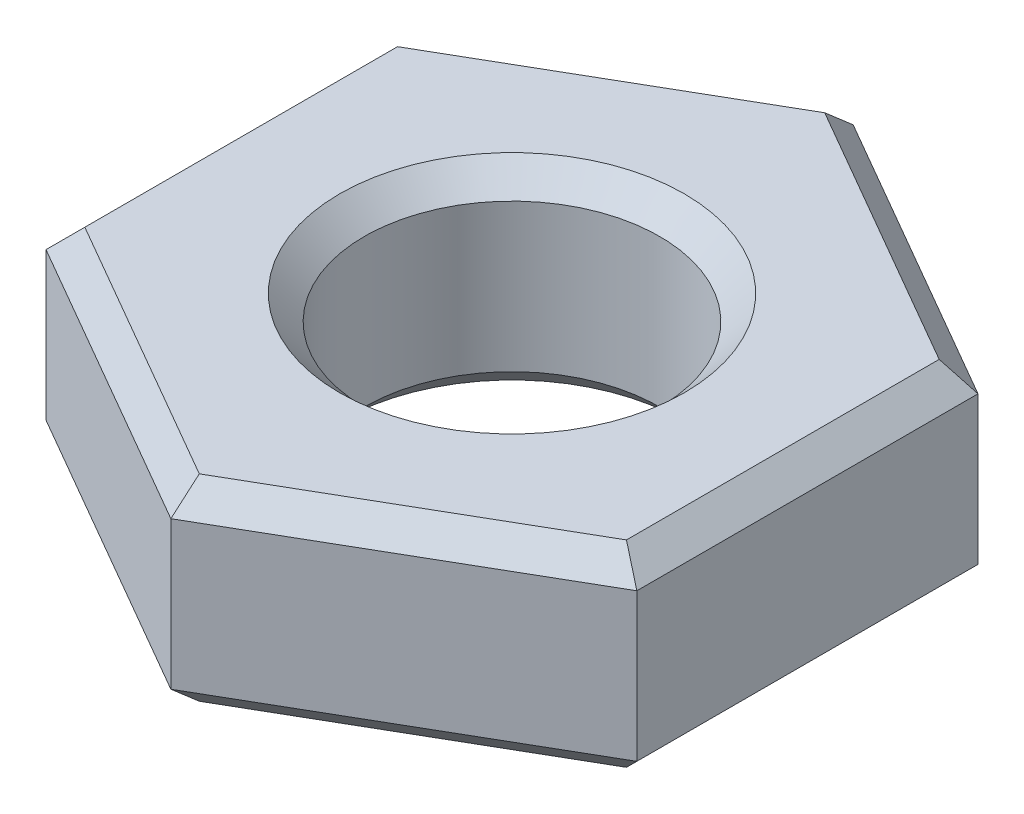
ISO-10303-21;
HEADER;
FILE_DESCRIPTION(('STEP AP214'),'2;1');
FILE_NAME('part.step','',(''),(''),'','','');
FILE_SCHEMA(('AUTOMOTIVE_DESIGN { 1 0 10303 214 1 1 1 1 }'));
ENDSEC;
DATA;
#1=APPLICATION_CONTEXT('core data for automotive mechanical design processes');
#2=APPLICATION_PROTOCOL_DEFINITION('international standard','automotive_design',2000,#1);
#3=PRODUCT_CONTEXT('',#1,'mechanical');
#4=PRODUCT('Part','Part','',(#3));
#5=PRODUCT_RELATED_PRODUCT_CATEGORY('part','',(#4));
#6=PRODUCT_DEFINITION_FORMATION('','',#4);
#7=PRODUCT_DEFINITION_CONTEXT('part definition',#1,'design');
#8=PRODUCT_DEFINITION('design','',#6,#7);
#9=PRODUCT_DEFINITION_SHAPE('','',#8);
#10=(LENGTH_UNIT() NAMED_UNIT(*) SI_UNIT(.MILLI.,.METRE.));
#11=(NAMED_UNIT(*) PLANE_ANGLE_UNIT() SI_UNIT($,.RADIAN.));
#12=(NAMED_UNIT(*) SI_UNIT($,.STERADIAN.) SOLID_ANGLE_UNIT());
#13=UNCERTAINTY_MEASURE_WITH_UNIT(LENGTH_MEASURE(1.E-05),#10,'distance_accuracy_value','');
#14=(GEOMETRIC_REPRESENTATION_CONTEXT(3) GLOBAL_UNCERTAINTY_ASSIGNED_CONTEXT((#13)) GLOBAL_UNIT_ASSIGNED_CONTEXT((#10,
#11,#12)) REPRESENTATION_CONTEXT('',''));
#15=CARTESIAN_POINT('',(0.,0.,0.));
#16=DIRECTION('',(0.,0.,1.));
#17=DIRECTION('',(1.,0.,0.));
#18=AXIS2_PLACEMENT_3D('',#15,#16,#17);
#19=CARTESIAN_POINT('',(0.,2.,0.));
#20=DIRECTION('',(0.,1.,0.));
#21=DIRECTION('',(0.,0.,1.));
#22=AXIS2_PLACEMENT_3D('',#19,#20,#21);
#23=PLANE('',#22);
#24=CARTESIAN_POINT('',(0.,2.,0.));
#25=DIRECTION('',(0.,1.,0.));
#26=DIRECTION('',(0.,0.,1.));
#27=AXIS2_PLACEMENT_3D('',#24,#25,#26);
#28=CIRCLE('',#27,1.75);
#29=CARTESIAN_POINT('',(0.,2.,1.75));
#30=VERTEX_POINT('',#29);
#31=EDGE_CURVE('E11',#30,#30,#28,.F.);
#32=ORIENTED_EDGE('',*,*,#31,.T.);
#33=EDGE_LOOP('',(#32));
#34=FACE_BOUND('',#33,.T.);
#35=DIRECTION('',(-0.866025403784439,0.,0.5));
#36=VECTOR('',#35,1.);
#37=CARTESIAN_POINT('',(-2.875,2.,-1.51554445662277));
#38=LINE('',#37,#36);
#39=CARTESIAN_POINT('',(0.,2.,-3.17542648054294));
#40=VERTEX_POINT('',#39);
#41=CARTESIAN_POINT('',(-2.75,2.,-1.58771324027147));
#42=VERTEX_POINT('',#41);
#43=EDGE_CURVE('E60',#40,#42,#38,.T.);
#44=ORIENTED_EDGE('',*,*,#43,.T.);
#45=DIRECTION('',(0.,0.,1.));
#46=VECTOR('',#45,1.);
#47=CARTESIAN_POINT('',(-2.75,2.,1.73205080756888));
#48=LINE('',#47,#46);
#49=CARTESIAN_POINT('',(-2.75,2.,1.58771324027147));
#50=VERTEX_POINT('',#49);
#51=EDGE_CURVE('E52',#42,#50,#48,.T.);
#52=ORIENTED_EDGE('',*,*,#51,.T.);
#53=DIRECTION('',(0.866025403784439,0.,0.5));
#54=VECTOR('',#53,1.);
#55=CARTESIAN_POINT('',(0.125,2.,3.24759526419165));
#56=LINE('',#55,#54);
#57=CARTESIAN_POINT('',(0.,2.,3.17542648054294));
#58=VERTEX_POINT('',#57);
#59=EDGE_CURVE('E218',#50,#58,#56,.T.);
#60=ORIENTED_EDGE('',*,*,#59,.T.);
#61=DIRECTION('',(0.866025403784439,0.,-0.5));
#62=VECTOR('',#61,1.);
#63=CARTESIAN_POINT('',(2.875,2.,1.51554445662277));
#64=LINE('',#63,#62);
#65=CARTESIAN_POINT('',(2.75,2.,1.58771324027147));
#66=VERTEX_POINT('',#65);
#67=EDGE_CURVE('E221',#58,#66,#64,.T.);
#68=ORIENTED_EDGE('',*,*,#67,.T.);
#69=DIRECTION('',(0.,0.,-1.));
#70=VECTOR('',#69,1.);
#71=CARTESIAN_POINT('',(2.75,2.,-1.73205080756888));
#72=LINE('',#71,#70);
#73=CARTESIAN_POINT('',(2.75,2.,-1.58771324027147));
#74=VERTEX_POINT('',#73);
#75=EDGE_CURVE('E224',#66,#74,#72,.T.);
#76=ORIENTED_EDGE('',*,*,#75,.T.);
#77=DIRECTION('',(-0.866025403784439,0.,-0.5));
#78=VECTOR('',#77,1.);
#79=CARTESIAN_POINT('',(-0.125,2.,-3.24759526419165));
#80=LINE('',#79,#78);
#81=EDGE_CURVE('E65',#74,#40,#80,.T.);
#82=ORIENTED_EDGE('',*,*,#81,.T.);
#83=EDGE_LOOP('',(#44,#52,#60,#68,#76,#82));
#84=FACE_BOUND('',#83,.T.);
#85=ADVANCED_FACE('F41',(#34,#84),#23,.T.);
#86=CARTESIAN_POINT('',(0.,0.,0.));
#87=DIRECTION('',(0.,1.,0.));
#88=DIRECTION('',(0.,0.,1.));
#89=AXIS2_PLACEMENT_3D('',#86,#87,#88);
#90=PLANE('',#89);
#91=CARTESIAN_POINT('',(0.,0.,0.));
#92=DIRECTION('',(0.,1.,0.));
#93=DIRECTION('',(0.,0.,1.));
#94=AXIS2_PLACEMENT_3D('',#91,#92,#93);
#95=CIRCLE('',#94,1.75);
#96=CARTESIAN_POINT('',(0.,0.,1.75));
#97=VERTEX_POINT('',#96);
#98=EDGE_CURVE('E164',#97,#97,#95,.T.);
#99=ORIENTED_EDGE('',*,*,#98,.T.);
#100=EDGE_LOOP('',(#99));
#101=FACE_BOUND('',#100,.T.);
#102=DIRECTION('',(0.,0.,1.));
#103=VECTOR('',#102,1.);
#104=CARTESIAN_POINT('',(2.75,0.,0.));
#105=LINE('',#104,#103);
#106=CARTESIAN_POINT('',(2.75,0.,-1.58771324027147));
#107=VERTEX_POINT('',#106);
#108=CARTESIAN_POINT('',(2.75,0.,1.58771324027147));
#109=VERTEX_POINT('',#108);
#110=EDGE_CURVE('E162',#107,#109,#105,.T.);
#111=ORIENTED_EDGE('',*,*,#110,.T.);
#112=DIRECTION('',(-0.866025403784439,0.,0.5));
#113=VECTOR('',#112,1.);
#114=CARTESIAN_POINT('',(1.375,0.,2.38156986040721));
#115=LINE('',#114,#113);
#116=CARTESIAN_POINT('',(0.,0.,3.17542648054294));
#117=VERTEX_POINT('',#116);
#118=EDGE_CURVE('E139',#109,#117,#115,.T.);
#119=ORIENTED_EDGE('',*,*,#118,.T.);
#120=DIRECTION('',(-0.866025403784439,0.,-0.5));
#121=VECTOR('',#120,1.);
#122=CARTESIAN_POINT('',(-1.375,0.,2.38156986040721));
#123=LINE('',#122,#121);
#124=CARTESIAN_POINT('',(-2.75,0.,1.58771324027147));
#125=VERTEX_POINT('',#124);
#126=EDGE_CURVE('E150',#117,#125,#123,.T.);
#127=ORIENTED_EDGE('',*,*,#126,.T.);
#128=DIRECTION('',(0.,0.,-1.));
#129=VECTOR('',#128,1.);
#130=CARTESIAN_POINT('',(-2.75,0.,0.));
#131=LINE('',#130,#129);
#132=CARTESIAN_POINT('',(-2.75,0.,-1.58771324027147));
#133=VERTEX_POINT('',#132);
#134=EDGE_CURVE('E157',#125,#133,#131,.T.);
#135=ORIENTED_EDGE('',*,*,#134,.T.);
#136=DIRECTION('',(0.866025403784439,0.,-0.5));
#137=VECTOR('',#136,1.);
#138=CARTESIAN_POINT('',(-1.375,0.,-2.38156986040721));
#139=LINE('',#138,#137);
#140=CARTESIAN_POINT('',(0.,0.,-3.17542648054294));
#141=VERTEX_POINT('',#140);
#142=EDGE_CURVE('E301',#133,#141,#139,.T.);
#143=ORIENTED_EDGE('',*,*,#142,.T.);
#144=DIRECTION('',(0.866025403784439,0.,0.5));
#145=VECTOR('',#144,1.);
#146=CARTESIAN_POINT('',(1.375,0.,-2.38156986040721));
#147=LINE('',#146,#145);
#148=EDGE_CURVE('E171',#141,#107,#147,.T.);
#149=ORIENTED_EDGE('',*,*,#148,.T.);
#150=EDGE_LOOP('',(#111,#119,#127,#135,#143,#149));
#151=FACE_BOUND('',#150,.T.);
#152=ADVANCED_FACE('F160',(#101,#151),#90,.F.);
#153=CARTESIAN_POINT('',(-3.,2.,1.73205080756888));
#154=DIRECTION('',(0.5,0.,-0.866025403784439));
#155=DIRECTION('',(-0.866025403784439,0.,-0.5));
#156=AXIS2_PLACEMENT_3D('',#153,#154,#155);
#157=PLANE('',#156);
#158=DIRECTION('',(0.,-1.,0.));
#159=VECTOR('',#158,1.);
#160=CARTESIAN_POINT('',(-3.,2.,1.73205080756888));
#161=LINE('',#160,#159);
#162=CARTESIAN_POINT('',(-3.,1.75,1.73205080756888));
#163=VERTEX_POINT('',#162);
#164=CARTESIAN_POINT('',(-3.,0.25,1.73205080756888));
#165=VERTEX_POINT('',#164);
#166=EDGE_CURVE('E248',#163,#165,#161,.T.);
#167=ORIENTED_EDGE('',*,*,#166,.T.);
#168=DIRECTION('',(0.866025403784439,0.,0.5));
#169=VECTOR('',#168,1.);
#170=CARTESIAN_POINT('',(-3.,0.25,1.73205080756888));
#171=LINE('',#170,#169);
#172=CARTESIAN_POINT('',(0.,0.25,3.46410161513775));
#173=VERTEX_POINT('',#172);
#174=EDGE_CURVE('E215',#165,#173,#171,.T.);
#175=ORIENTED_EDGE('',*,*,#174,.T.);
#176=DIRECTION('',(0.,-1.,0.));
#177=VECTOR('',#176,1.);
#178=CARTESIAN_POINT('',(0.,2.,3.46410161513775));
#179=LINE('',#178,#177);
#180=CARTESIAN_POINT('',(0.,1.75,3.46410161513775));
#181=VERTEX_POINT('',#180);
#182=EDGE_CURVE('E158',#181,#173,#179,.T.);
#183=ORIENTED_EDGE('',*,*,#182,.F.);
#184=DIRECTION('',(-0.866025403784439,0.,-0.5));
#185=VECTOR('',#184,1.);
#186=CARTESIAN_POINT('',(-3.,1.75,1.73205080756888));
#187=LINE('',#186,#185);
#188=EDGE_CURVE('E212',#181,#163,#187,.T.);
#189=ORIENTED_EDGE('',*,*,#188,.T.);
#190=EDGE_LOOP('',(#167,#175,#183,#189));
#191=FACE_BOUND('',#190,.T.);
#192=ADVANCED_FACE('F330',(#191),#157,.F.);
#193=CARTESIAN_POINT('',(0.,2.,3.46410161513775));
#194=DIRECTION('',(-0.5,0.,-0.866025403784439));
#195=DIRECTION('',(-0.866025403784439,0.,0.5));
#196=AXIS2_PLACEMENT_3D('',#193,#194,#195);
#197=PLANE('',#196);
#198=ORIENTED_EDGE('',*,*,#182,.T.);
#199=DIRECTION('',(0.866025403784439,0.,-0.5));
#200=VECTOR('',#199,1.);
#201=CARTESIAN_POINT('',(0.,0.249999999999999,3.46410161513775));
#202=LINE('',#201,#200);
#203=CARTESIAN_POINT('',(3.,0.249999999999999,1.73205080756888));
#204=VERTEX_POINT('',#203);
#205=EDGE_CURVE('E142',#173,#204,#202,.T.);
#206=ORIENTED_EDGE('',*,*,#205,.T.);
#207=DIRECTION('',(0.,-1.,0.));
#208=VECTOR('',#207,1.);
#209=CARTESIAN_POINT('',(3.,2.,1.73205080756888));
#210=LINE('',#209,#208);
#211=CARTESIAN_POINT('',(3.,1.75,1.73205080756888));
#212=VERTEX_POINT('',#211);
#213=EDGE_CURVE('E283',#212,#204,#210,.T.);
#214=ORIENTED_EDGE('',*,*,#213,.F.);
#215=DIRECTION('',(-0.866025403784439,0.,0.5));
#216=VECTOR('',#215,1.);
#217=CARTESIAN_POINT('',(0.,1.75,3.46410161513775));
#218=LINE('',#217,#216);
#219=EDGE_CURVE('E182',#212,#181,#218,.T.);
#220=ORIENTED_EDGE('',*,*,#219,.T.);
#221=EDGE_LOOP('',(#198,#206,#214,#220));
#222=FACE_BOUND('',#221,.T.);
#223=ADVANCED_FACE('F288',(#222),#197,.F.);
#224=CARTESIAN_POINT('',(3.,2.,1.73205080756888));
#225=DIRECTION('',(-1.,0.,0.));
#226=DIRECTION('',(0.,0.,1.));
#227=AXIS2_PLACEMENT_3D('',#224,#225,#226);
#228=PLANE('',#227);
#229=ORIENTED_EDGE('',*,*,#213,.T.);
#230=DIRECTION('',(0.,0.,-1.));
#231=VECTOR('',#230,1.);
#232=CARTESIAN_POINT('',(3.,0.249999999999999,1.73205080756888));
#233=LINE('',#232,#231);
#234=CARTESIAN_POINT('',(3.,0.25,-1.73205080756888));
#235=VERTEX_POINT('',#234);
#236=EDGE_CURVE('E190',#204,#235,#233,.T.);
#237=ORIENTED_EDGE('',*,*,#236,.T.);
#238=DIRECTION('',(0.,-1.,0.));
#239=VECTOR('',#238,1.);
#240=CARTESIAN_POINT('',(3.,2.,-1.73205080756888));
#241=LINE('',#240,#239);
#242=CARTESIAN_POINT('',(3.,1.75,-1.73205080756888));
#243=VERTEX_POINT('',#242);
#244=EDGE_CURVE('E285',#243,#235,#241,.T.);
#245=ORIENTED_EDGE('',*,*,#244,.F.);
#246=DIRECTION('',(0.,0.,1.));
#247=VECTOR('',#246,1.);
#248=CARTESIAN_POINT('',(3.,1.75,1.73205080756888));
#249=LINE('',#248,#247);
#250=EDGE_CURVE('E187',#243,#212,#249,.T.);
#251=ORIENTED_EDGE('',*,*,#250,.T.);
#252=EDGE_LOOP('',(#229,#237,#245,#251));
#253=FACE_BOUND('',#252,.T.);
#254=ADVANCED_FACE('F282',(#253),#228,.F.);
#255=CARTESIAN_POINT('',(3.,2.,-1.73205080756888));
#256=DIRECTION('',(-0.5,0.,0.866025403784439));
#257=DIRECTION('',(0.866025403784439,0.,0.5));
#258=AXIS2_PLACEMENT_3D('',#255,#256,#257);
#259=PLANE('',#258);
#260=ORIENTED_EDGE('',*,*,#244,.T.);
#261=DIRECTION('',(-0.866025403784439,0.,-0.5));
#262=VECTOR('',#261,1.);
#263=CARTESIAN_POINT('',(3.,0.25,-1.73205080756888));
#264=LINE('',#263,#262);
#265=CARTESIAN_POINT('',(0.,0.249999999999999,-3.46410161513776));
#266=VERTEX_POINT('',#265);
#267=EDGE_CURVE('E196',#235,#266,#264,.T.);
#268=ORIENTED_EDGE('',*,*,#267,.T.);
#269=DIRECTION('',(0.,-1.,0.));
#270=VECTOR('',#269,1.);
#271=CARTESIAN_POINT('',(0.,2.,-3.46410161513776));
#272=LINE('',#271,#270);
#273=CARTESIAN_POINT('',(0.,1.75,-3.46410161513776));
#274=VERTEX_POINT('',#273);
#275=EDGE_CURVE('E295',#274,#266,#272,.T.);
#276=ORIENTED_EDGE('',*,*,#275,.F.);
#277=DIRECTION('',(0.866025403784439,0.,0.5));
#278=VECTOR('',#277,1.);
#279=CARTESIAN_POINT('',(3.,1.75,-1.73205080756888));
#280=LINE('',#279,#278);
#281=EDGE_CURVE('E193',#274,#243,#280,.T.);
#282=ORIENTED_EDGE('',*,*,#281,.T.);
#283=EDGE_LOOP('',(#260,#268,#276,#282));
#284=FACE_BOUND('',#283,.T.);
#285=ADVANCED_FACE('F315',(#284),#259,.F.);
#286=CARTESIAN_POINT('',(0.,2.,-3.46410161513776));
#287=DIRECTION('',(0.5,0.,0.866025403784439));
#288=DIRECTION('',(0.866025403784439,0.,-0.5));
#289=AXIS2_PLACEMENT_3D('',#286,#287,#288);
#290=PLANE('',#289);
#291=ORIENTED_EDGE('',*,*,#275,.T.);
#292=DIRECTION('',(-0.866025403784439,0.,0.5));
#293=VECTOR('',#292,1.);
#294=CARTESIAN_POINT('',(0.,0.249999999999999,-3.46410161513776));
#295=LINE('',#294,#293);
#296=CARTESIAN_POINT('',(-3.,0.249999999999999,-1.73205080756888));
#297=VERTEX_POINT('',#296);
#298=EDGE_CURVE('E202',#266,#297,#295,.T.);
#299=ORIENTED_EDGE('',*,*,#298,.T.);
#300=DIRECTION('',(0.,-1.,0.));
#301=VECTOR('',#300,1.);
#302=CARTESIAN_POINT('',(-3.,2.,-1.73205080756888));
#303=LINE('',#302,#301);
#304=CARTESIAN_POINT('',(-3.,1.75,-1.73205080756888));
#305=VERTEX_POINT('',#304);
#306=EDGE_CURVE('E321',#305,#297,#303,.T.);
#307=ORIENTED_EDGE('',*,*,#306,.F.);
#308=DIRECTION('',(0.866025403784439,0.,-0.5));
#309=VECTOR('',#308,1.);
#310=CARTESIAN_POINT('',(0.,1.75,-3.46410161513776));
#311=LINE('',#310,#309);
#312=EDGE_CURVE('E199',#305,#274,#311,.T.);
#313=ORIENTED_EDGE('',*,*,#312,.T.);
#314=EDGE_LOOP('',(#291,#299,#307,#313));
#315=FACE_BOUND('',#314,.T.);
#316=ADVANCED_FACE('F341',(#315),#290,.F.);
#317=CARTESIAN_POINT('',(-3.,2.,-1.73205080756888));
#318=DIRECTION('',(1.,0.,0.));
#319=DIRECTION('',(0.,0.,-1.));
#320=AXIS2_PLACEMENT_3D('',#317,#318,#319);
#321=PLANE('',#320);
#322=ORIENTED_EDGE('',*,*,#306,.T.);
#323=DIRECTION('',(0.,0.,1.));
#324=VECTOR('',#323,1.);
#325=CARTESIAN_POINT('',(-3.,0.249999999999999,-1.73205080756888));
#326=LINE('',#325,#324);
#327=EDGE_CURVE('E209',#297,#165,#326,.T.);
#328=ORIENTED_EDGE('',*,*,#327,.T.);
#329=ORIENTED_EDGE('',*,*,#166,.F.);
#330=DIRECTION('',(0.,0.,-1.));
#331=VECTOR('',#330,1.);
#332=CARTESIAN_POINT('',(-3.,1.75,-1.73205080756888));
#333=LINE('',#332,#331);
#334=EDGE_CURVE('E205',#163,#305,#333,.T.);
#335=ORIENTED_EDGE('',*,*,#334,.T.);
#336=EDGE_LOOP('',(#322,#328,#329,#335));
#337=FACE_BOUND('',#336,.T.);
#338=ADVANCED_FACE('F342',(#337),#321,.F.);
#339=CARTESIAN_POINT('',(0.,2.,0.));
#340=DIRECTION('',(0.,-1.,0.));
#341=DIRECTION('',(0.,0.,-1.));
#342=AXIS2_PLACEMENT_3D('',#339,#340,#341);
#343=CYLINDRICAL_SURFACE('',#342,1.5);
#344=CARTESIAN_POINT('',(0.,0.25,0.));
#345=DIRECTION('',(0.,1.,0.));
#346=DIRECTION('',(0.,0.,1.));
#347=AXIS2_PLACEMENT_3D('',#344,#345,#346);
#348=CIRCLE('',#347,1.5);
#349=CARTESIAN_POINT('',(0.,0.25,1.5));
#350=VERTEX_POINT('',#349);
#351=EDGE_CURVE('E178',#350,#350,#348,.F.);
#352=ORIENTED_EDGE('',*,*,#351,.T.);
#353=EDGE_LOOP('',(#352));
#354=FACE_BOUND('',#353,.T.);
#355=CARTESIAN_POINT('',(0.,1.75,0.));
#356=DIRECTION('',(0.,1.,0.));
#357=DIRECTION('',(0.,0.,1.));
#358=AXIS2_PLACEMENT_3D('',#355,#356,#357);
#359=CIRCLE('',#358,1.5);
#360=CARTESIAN_POINT('',(0.,1.75,1.5));
#361=VERTEX_POINT('',#360);
#362=EDGE_CURVE('E169',#361,#361,#359,.T.);
#363=ORIENTED_EDGE('',*,*,#362,.T.);
#364=EDGE_LOOP('',(#363));
#365=FACE_BOUND('',#364,.T.);
#366=ADVANCED_FACE('F361',(#354,#365),#343,.F.);
#367=CARTESIAN_POINT('',(0.,0.,0.));
#368=DIRECTION('',(0.,-1.,0.));
#369=DIRECTION('',(0.,0.,-1.));
#370=AXIS2_PLACEMENT_3D('',#367,#368,#369);
#371=CONICAL_SURFACE('',#370,1.75,0.785398163397445);
#372=ORIENTED_EDGE('',*,*,#351,.F.);
#373=EDGE_LOOP('',(#372));
#374=FACE_BOUND('',#373,.T.);
#375=ORIENTED_EDGE('',*,*,#98,.F.);
#376=EDGE_LOOP('',(#375));
#377=FACE_BOUND('',#376,.T.);
#378=ADVANCED_FACE('F376',(#374,#377),#371,.F.);
#379=CARTESIAN_POINT('',(0.,0.249999999999999,-3.46410161513776));
#380=DIRECTION('',(0.353553390593273,0.707106781186549,0.612372435695793));
#381=DIRECTION('',(-0.866025403784439,0.,0.5));
#382=AXIS2_PLACEMENT_3D('',#379,#380,#381);
#383=PLANE('',#382);
#384=DIRECTION('',(0.,-0.654653670707976,0.755928946018456));
#385=VECTOR('',#384,1.);
#386=CARTESIAN_POINT('',(0.,0.249999999999999,-3.46410161513776));
#387=LINE('',#386,#385);
#388=EDGE_CURVE('E240',#141,#266,#387,.F.);
#389=ORIENTED_EDGE('',*,*,#388,.F.);
#390=ORIENTED_EDGE('',*,*,#142,.F.);
#391=DIRECTION('',(0.654653670707978,-0.654653670707976,0.377964473009228));
#392=VECTOR('',#391,1.);
#393=CARTESIAN_POINT('',(-3.,0.249999999999999,-1.73205080756888));
#394=LINE('',#393,#392);
#395=EDGE_CURVE('E244',#297,#133,#394,.T.);
#396=ORIENTED_EDGE('',*,*,#395,.F.);
#397=ORIENTED_EDGE('',*,*,#298,.F.);
#398=EDGE_LOOP('',(#389,#390,#396,#397));
#399=FACE_BOUND('',#398,.T.);
#400=ADVANCED_FACE('F339',(#399),#383,.F.);
#401=CARTESIAN_POINT('',(-3.,0.249999999999999,-1.73205080756888));
#402=DIRECTION('',(0.707106781186546,0.707106781186549,0.));
#403=DIRECTION('',(0.,0.,1.));
#404=AXIS2_PLACEMENT_3D('',#401,#402,#403);
#405=PLANE('',#404);
#406=ORIENTED_EDGE('',*,*,#395,.T.);
#407=ORIENTED_EDGE('',*,*,#134,.F.);
#408=DIRECTION('',(0.654653670707978,-0.654653670707975,-0.377964473009228));
#409=VECTOR('',#408,1.);
#410=CARTESIAN_POINT('',(-3.,0.249999999999999,1.73205080756888));
#411=LINE('',#410,#409);
#412=EDGE_CURVE('E153',#165,#125,#411,.T.);
#413=ORIENTED_EDGE('',*,*,#412,.F.);
#414=ORIENTED_EDGE('',*,*,#327,.F.);
#415=EDGE_LOOP('',(#406,#407,#413,#414));
#416=FACE_BOUND('',#415,.T.);
#417=ADVANCED_FACE('F336',(#416),#405,.F.);
#418=CARTESIAN_POINT('',(3.,0.249999999999999,-1.73205080756888));
#419=DIRECTION('',(-0.353553390593273,0.707106781186549,0.612372435695793));
#420=DIRECTION('',(-0.866025403784439,0.,-0.5));
#421=AXIS2_PLACEMENT_3D('',#418,#419,#420);
#422=PLANE('',#421);
#423=ORIENTED_EDGE('',*,*,#388,.T.);
#424=ORIENTED_EDGE('',*,*,#267,.F.);
#425=DIRECTION('',(-0.654653670707978,-0.654653670707976,0.377964473009229));
#426=VECTOR('',#425,1.);
#427=CARTESIAN_POINT('',(3.,0.249999999999999,-1.73205080756888));
#428=LINE('',#427,#426);
#429=EDGE_CURVE('E146',#107,#235,#428,.F.);
#430=ORIENTED_EDGE('',*,*,#429,.F.);
#431=ORIENTED_EDGE('',*,*,#148,.F.);
#432=EDGE_LOOP('',(#423,#424,#430,#431));
#433=FACE_BOUND('',#432,.T.);
#434=ADVANCED_FACE('F310',(#433),#422,.F.);
#435=CARTESIAN_POINT('',(-3.,0.249999999999999,1.73205080756888));
#436=DIRECTION('',(0.353553390593273,0.707106781186549,-0.612372435695793));
#437=DIRECTION('',(0.866025403784439,0.,0.5));
#438=AXIS2_PLACEMENT_3D('',#435,#436,#437);
#439=PLANE('',#438);
#440=ORIENTED_EDGE('',*,*,#412,.T.);
#441=ORIENTED_EDGE('',*,*,#126,.F.);
#442=DIRECTION('',(0.,0.654653670707976,0.755928946018456));
#443=VECTOR('',#442,1.);
#444=CARTESIAN_POINT('',(0.,-0.607142857142856,2.47435829652697));
#445=LINE('',#444,#443);
#446=EDGE_CURVE('E135',#173,#117,#445,.F.);
#447=ORIENTED_EDGE('',*,*,#446,.F.);
#448=ORIENTED_EDGE('',*,*,#174,.F.);
#449=EDGE_LOOP('',(#440,#441,#447,#448));
#450=FACE_BOUND('',#449,.T.);
#451=ADVANCED_FACE('F151',(#450),#439,.F.);
#452=CARTESIAN_POINT('',(3.,0.249999999999999,1.73205080756888));
#453=DIRECTION('',(-0.707106781186546,0.707106781186549,0.));
#454=DIRECTION('',(0.,0.,-1.));
#455=AXIS2_PLACEMENT_3D('',#452,#453,#454);
#456=PLANE('',#455);
#457=ORIENTED_EDGE('',*,*,#429,.T.);
#458=ORIENTED_EDGE('',*,*,#236,.F.);
#459=DIRECTION('',(-0.654653670707978,-0.654653670707976,-0.377964473009228));
#460=VECTOR('',#459,1.);
#461=CARTESIAN_POINT('',(3.,0.249999999999999,1.73205080756888));
#462=LINE('',#461,#460);
#463=EDGE_CURVE('E147',#109,#204,#462,.F.);
#464=ORIENTED_EDGE('',*,*,#463,.F.);
#465=ORIENTED_EDGE('',*,*,#110,.F.);
#466=EDGE_LOOP('',(#457,#458,#464,#465));
#467=FACE_BOUND('',#466,.T.);
#468=ADVANCED_FACE('F313',(#467),#456,.F.);
#469=CARTESIAN_POINT('',(0.,0.249999999999999,3.46410161513775));
#470=DIRECTION('',(-0.353553390593273,0.707106781186549,-0.612372435695793));
#471=DIRECTION('',(0.866025403784439,0.,-0.5));
#472=AXIS2_PLACEMENT_3D('',#469,#470,#471);
#473=PLANE('',#472);
#474=ORIENTED_EDGE('',*,*,#446,.T.);
#475=ORIENTED_EDGE('',*,*,#118,.F.);
#476=ORIENTED_EDGE('',*,*,#463,.T.);
#477=ORIENTED_EDGE('',*,*,#205,.F.);
#478=EDGE_LOOP('',(#474,#475,#476,#477));
#479=FACE_BOUND('',#478,.T.);
#480=ADVANCED_FACE('F137',(#479),#473,.F.);
#481=CARTESIAN_POINT('',(0.,1.75,0.));
#482=DIRECTION('',(0.,1.,0.));
#483=DIRECTION('',(0.,0.,1.));
#484=AXIS2_PLACEMENT_3D('',#481,#482,#483);
#485=CONICAL_SURFACE('',#484,1.5,0.785398163397448);
#486=ORIENTED_EDGE('',*,*,#31,.F.);
#487=EDGE_LOOP('',(#486));
#488=FACE_BOUND('',#487,.T.);
#489=ORIENTED_EDGE('',*,*,#362,.F.);
#490=EDGE_LOOP('',(#489));
#491=FACE_BOUND('',#490,.T.);
#492=ADVANCED_FACE('F390',(#488,#491),#485,.F.);
#493=CARTESIAN_POINT('',(2.75,2.,0.));
#494=DIRECTION('',(0.707106781186549,0.707106781186546,0.));
#495=DIRECTION('',(0.,0.,1.));
#496=AXIS2_PLACEMENT_3D('',#493,#494,#495);
#497=PLANE('',#496);
#498=DIRECTION('',(-0.654653670707977,0.654653670707979,-0.377964473009226));
#499=VECTOR('',#498,1.);
#500=CARTESIAN_POINT('',(2.35714285714286,2.39285714285714,1.36089706308983));
#501=LINE('',#500,#499);
#502=EDGE_CURVE('E262',#212,#66,#501,.T.);
#503=ORIENTED_EDGE('',*,*,#502,.F.);
#504=ORIENTED_EDGE('',*,*,#250,.F.);
#505=DIRECTION('',(-0.654653670707976,0.654653670707979,0.377964473009226));
#506=VECTOR('',#505,1.);
#507=CARTESIAN_POINT('',(2.35714285714286,2.39285714285714,-1.36089706308983));
#508=LINE('',#507,#506);
#509=EDGE_CURVE('E46',#74,#243,#508,.F.);
#510=ORIENTED_EDGE('',*,*,#509,.F.);
#511=ORIENTED_EDGE('',*,*,#75,.F.);
#512=EDGE_LOOP('',(#503,#504,#510,#511));
#513=FACE_BOUND('',#512,.T.);
#514=ADVANCED_FACE('F44',(#513),#497,.T.);
#515=CARTESIAN_POINT('',(1.375,2.,-2.38156986040721));
#516=DIRECTION('',(0.353553390593274,0.707106781186546,-0.612372435695796));
#517=DIRECTION('',(0.866025403784439,0.,0.5));
#518=AXIS2_PLACEMENT_3D('',#515,#516,#517);
#519=PLANE('',#518);
#520=ORIENTED_EDGE('',*,*,#509,.T.);
#521=ORIENTED_EDGE('',*,*,#281,.F.);
#522=DIRECTION('',(0.,0.654653670707978,0.755928946018453));
#523=VECTOR('',#522,1.);
#524=CARTESIAN_POINT('',(0.,2.39285714285714,-2.72179412617967));
#525=LINE('',#524,#523);
#526=EDGE_CURVE('E259',#40,#274,#525,.F.);
#527=ORIENTED_EDGE('',*,*,#526,.F.);
#528=ORIENTED_EDGE('',*,*,#81,.F.);
#529=EDGE_LOOP('',(#520,#521,#527,#528));
#530=FACE_BOUND('',#529,.T.);
#531=ADVANCED_FACE('F274',(#530),#519,.T.);
#532=CARTESIAN_POINT('',(1.375,2.,2.38156986040721));
#533=DIRECTION('',(0.353553390593274,0.707106781186546,0.612372435695796));
#534=DIRECTION('',(-0.866025403784439,0.,0.5));
#535=AXIS2_PLACEMENT_3D('',#532,#533,#534);
#536=PLANE('',#535);
#537=ORIENTED_EDGE('',*,*,#502,.T.);
#538=ORIENTED_EDGE('',*,*,#67,.F.);
#539=DIRECTION('',(0.,0.654653670707979,-0.755928946018453));
#540=VECTOR('',#539,1.);
#541=CARTESIAN_POINT('',(0.,2.39285714285714,2.72179412617967));
#542=LINE('',#541,#540);
#543=EDGE_CURVE('E255',#181,#58,#542,.T.);
#544=ORIENTED_EDGE('',*,*,#543,.F.);
#545=ORIENTED_EDGE('',*,*,#219,.F.);
#546=EDGE_LOOP('',(#537,#538,#544,#545));
#547=FACE_BOUND('',#546,.T.);
#548=ADVANCED_FACE('F436',(#547),#536,.T.);
#549=CARTESIAN_POINT('',(-1.375,2.,-2.38156986040721));
#550=DIRECTION('',(-0.353553390593274,0.707106781186547,-0.612372435695795));
#551=DIRECTION('',(0.866025403784439,0.,-0.5));
#552=AXIS2_PLACEMENT_3D('',#549,#550,#551);
#553=PLANE('',#552);
#554=ORIENTED_EDGE('',*,*,#526,.T.);
#555=ORIENTED_EDGE('',*,*,#312,.F.);
#556=DIRECTION('',(0.654653670707975,0.654653670707979,0.377964473009229));
#557=VECTOR('',#556,1.);
#558=CARTESIAN_POINT('',(-2.35714285714286,2.39285714285714,-1.36089706308983));
#559=LINE('',#558,#557);
#560=EDGE_CURVE('E252',#42,#305,#559,.F.);
#561=ORIENTED_EDGE('',*,*,#560,.F.);
#562=ORIENTED_EDGE('',*,*,#43,.F.);
#563=EDGE_LOOP('',(#554,#555,#561,#562));
#564=FACE_BOUND('',#563,.T.);
#565=ADVANCED_FACE('F430',(#564),#553,.T.);
#566=CARTESIAN_POINT('',(-1.375,2.,2.38156986040721));
#567=DIRECTION('',(-0.353553390593275,0.707106781186546,0.612372435695796));
#568=DIRECTION('',(-0.866025403784439,0.,-0.5));
#569=AXIS2_PLACEMENT_3D('',#566,#567,#568);
#570=PLANE('',#569);
#571=ORIENTED_EDGE('',*,*,#543,.T.);
#572=ORIENTED_EDGE('',*,*,#59,.F.);
#573=DIRECTION('',(-0.654653670707975,-0.654653670707979,0.377964473009227));
#574=VECTOR('',#573,1.);
#575=CARTESIAN_POINT('',(-2.35714285714286,2.39285714285714,1.36089706308983));
#576=LINE('',#575,#574);
#577=EDGE_CURVE('E249',#163,#50,#576,.F.);
#578=ORIENTED_EDGE('',*,*,#577,.F.);
#579=ORIENTED_EDGE('',*,*,#188,.F.);
#580=EDGE_LOOP('',(#571,#572,#578,#579));
#581=FACE_BOUND('',#580,.T.);
#582=ADVANCED_FACE('F350',(#581),#570,.T.);
#583=CARTESIAN_POINT('',(-2.75,2.,0.));
#584=DIRECTION('',(-0.70710678118655,0.707106781186545,0.));
#585=DIRECTION('',(0.,0.,-1.));
#586=AXIS2_PLACEMENT_3D('',#583,#584,#585);
#587=PLANE('',#586);
#588=ORIENTED_EDGE('',*,*,#560,.T.);
#589=ORIENTED_EDGE('',*,*,#334,.F.);
#590=ORIENTED_EDGE('',*,*,#577,.T.);
#591=ORIENTED_EDGE('',*,*,#51,.F.);
#592=EDGE_LOOP('',(#588,#589,#590,#591));
#593=FACE_BOUND('',#592,.T.);
#594=ADVANCED_FACE('F345',(#593),#587,.T.);
#595=CLOSED_SHELL('',(#85,#152,#192,#223,#254,#285,#316,#338,#366,#378,#400,#417,#434,#451,#468,
#480,#492,#514,#531,#548,#565,#582,#594));
#596=MANIFOLD_SOLID_BREP('B2',#595);
#597=ADVANCED_BREP_SHAPE_REPRESENTATION('',(#18,#596),#14);
#598=SHAPE_DEFINITION_REPRESENTATION(#9,#597);
ENDSEC;
END-ISO-10303-21;
